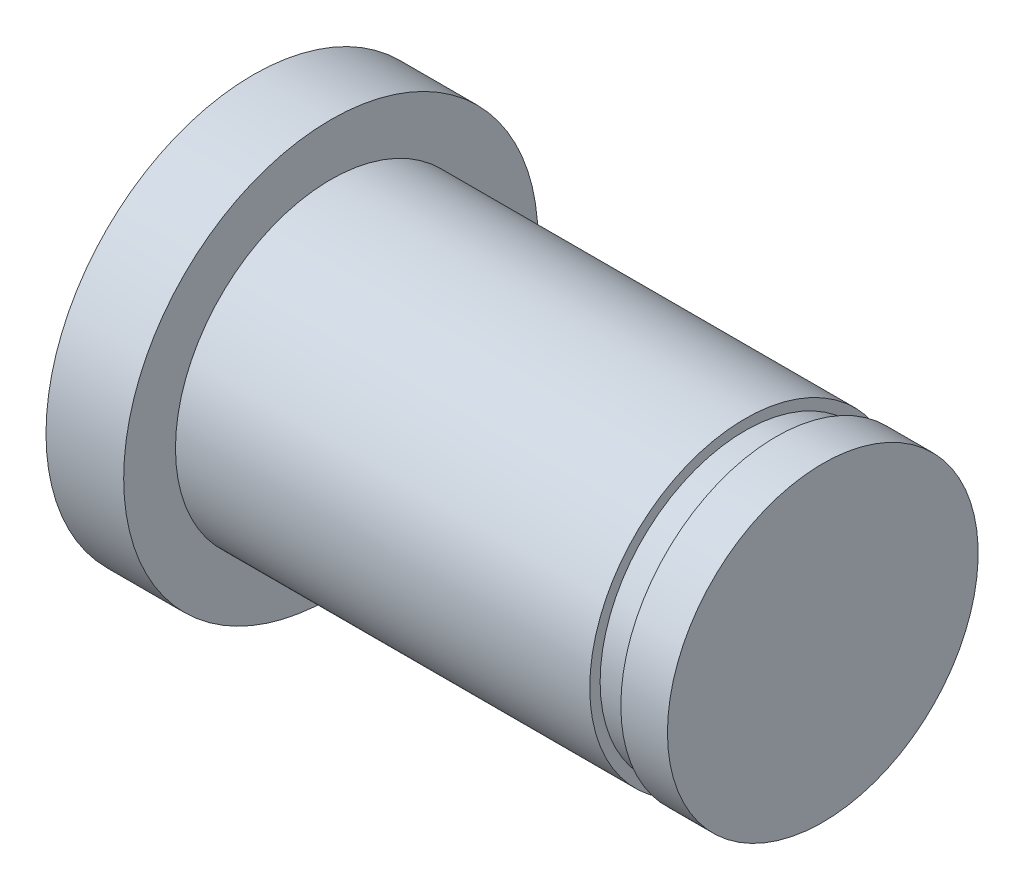
ISO-10303-21;
HEADER;
FILE_DESCRIPTION(('STEP AP214'),'2;1');
FILE_NAME('part.step','',(''),(''),'','','');
FILE_SCHEMA(('AUTOMOTIVE_DESIGN { 1 0 10303 214 1 1 1 1 }'));
ENDSEC;
DATA;
#1=APPLICATION_CONTEXT('core data for automotive mechanical design processes');
#2=APPLICATION_PROTOCOL_DEFINITION('international standard','automotive_design',2000,#1);
#3=PRODUCT_CONTEXT('',#1,'mechanical');
#4=PRODUCT('Part','Part','',(#3));
#5=PRODUCT_RELATED_PRODUCT_CATEGORY('part','',(#4));
#6=PRODUCT_DEFINITION_FORMATION('','',#4);
#7=PRODUCT_DEFINITION_CONTEXT('part definition',#1,'design');
#8=PRODUCT_DEFINITION('design','',#6,#7);
#9=PRODUCT_DEFINITION_SHAPE('','',#8);
#10=(LENGTH_UNIT() NAMED_UNIT(*) SI_UNIT(.MILLI.,.METRE.));
#11=(NAMED_UNIT(*) PLANE_ANGLE_UNIT() SI_UNIT($,.RADIAN.));
#12=(NAMED_UNIT(*) SI_UNIT($,.STERADIAN.) SOLID_ANGLE_UNIT());
#13=UNCERTAINTY_MEASURE_WITH_UNIT(LENGTH_MEASURE(1.E-05),#10,'distance_accuracy_value','');
#14=(GEOMETRIC_REPRESENTATION_CONTEXT(3) GLOBAL_UNCERTAINTY_ASSIGNED_CONTEXT((#13)) GLOBAL_UNIT_ASSIGNED_CONTEXT((#10,
#11,#12)) REPRESENTATION_CONTEXT('',''));
#15=CARTESIAN_POINT('',(0.,0.,0.));
#16=DIRECTION('',(0.,0.,1.));
#17=DIRECTION('',(1.,0.,0.));
#18=AXIS2_PLACEMENT_3D('',#15,#16,#17);
#19=CARTESIAN_POINT('',(11.,0.,-3.));
#20=DIRECTION('',(-1.,0.,0.));
#21=DIRECTION('',(0.,0.,1.));
#22=AXIS2_PLACEMENT_3D('',#19,#20,#21);
#23=PLANE('',#22);
#24=CARTESIAN_POINT('',(11.,0.,0.));
#25=DIRECTION('',(-1.,0.,0.));
#26=DIRECTION('',(0.,0.,1.));
#27=AXIS2_PLACEMENT_3D('',#24,#25,#26);
#28=CIRCLE('',#27,3.);
#29=CARTESIAN_POINT('',(11.,0.,3.));
#30=VERTEX_POINT('',#29);
#31=EDGE_CURVE('E18',#30,#30,#28,.T.);
#32=ORIENTED_EDGE('',*,*,#31,.F.);
#33=EDGE_LOOP('',(#32));
#34=FACE_BOUND('',#33,.T.);
#35=ADVANCED_FACE('F15',(#34),#23,.F.);
#36=CARTESIAN_POINT('',(0.,0.,0.));
#37=DIRECTION('',(-1.,0.,0.));
#38=DIRECTION('',(0.,0.,1.));
#39=AXIS2_PLACEMENT_3D('',#36,#37,#38);
#40=CYLINDRICAL_SURFACE('',#39,3.);
#41=CARTESIAN_POINT('',(10.1,0.,0.));
#42=DIRECTION('',(-1.,0.,0.));
#43=DIRECTION('',(0.,0.,1.));
#44=AXIS2_PLACEMENT_3D('',#41,#42,#43);
#45=CIRCLE('',#44,3.);
#46=CARTESIAN_POINT('',(10.1,0.,3.));
#47=VERTEX_POINT('',#46);
#48=EDGE_CURVE('E40',#47,#47,#45,.F.);
#49=ORIENTED_EDGE('',*,*,#48,.T.);
#50=EDGE_LOOP('',(#49));
#51=FACE_BOUND('',#50,.T.);
#52=ORIENTED_EDGE('',*,*,#31,.T.);
#53=EDGE_LOOP('',(#52));
#54=FACE_BOUND('',#53,.T.);
#55=ADVANCED_FACE('F47',(#51,#54),#40,.T.);
#56=CARTESIAN_POINT('',(10.1,0.,-2.8));
#57=DIRECTION('',(1.,0.,0.));
#58=DIRECTION('',(0.,0.,-1.));
#59=AXIS2_PLACEMENT_3D('',#56,#57,#58);
#60=PLANE('',#59);
#61=ORIENTED_EDGE('',*,*,#48,.F.);
#62=EDGE_LOOP('',(#61));
#63=FACE_BOUND('',#62,.T.);
#64=CARTESIAN_POINT('',(10.1,0.,0.));
#65=DIRECTION('',(-1.,0.,0.));
#66=DIRECTION('',(0.,0.,1.));
#67=AXIS2_PLACEMENT_3D('',#64,#65,#66);
#68=CIRCLE('',#67,2.8);
#69=CARTESIAN_POINT('',(10.1,0.,2.8));
#70=VERTEX_POINT('',#69);
#71=EDGE_CURVE('E38',#70,#70,#68,.T.);
#72=ORIENTED_EDGE('',*,*,#71,.F.);
#73=EDGE_LOOP('',(#72));
#74=FACE_BOUND('',#73,.T.);
#75=ADVANCED_FACE('F54',(#63,#74),#60,.F.);
#76=CARTESIAN_POINT('',(0.,0.,0.));
#77=DIRECTION('',(1.,0.,0.));
#78=DIRECTION('',(0.,0.,-1.));
#79=AXIS2_PLACEMENT_3D('',#76,#77,#78);
#80=PLANE('',#79);
#81=CARTESIAN_POINT('',(0.,0.,0.));
#82=DIRECTION('',(-1.,0.,0.));
#83=DIRECTION('',(0.,0.,1.));
#84=AXIS2_PLACEMENT_3D('',#81,#82,#83);
#85=CIRCLE('',#84,4.);
#86=CARTESIAN_POINT('',(0.,0.,4.));
#87=VERTEX_POINT('',#86);
#88=EDGE_CURVE('E35',#87,#87,#85,.F.);
#89=ORIENTED_EDGE('',*,*,#88,.F.);
#90=EDGE_LOOP('',(#89));
#91=FACE_BOUND('',#90,.T.);
#92=ADVANCED_FACE('F77',(#91),#80,.F.);
#93=CARTESIAN_POINT('',(0.,0.,0.));
#94=DIRECTION('',(-1.,0.,0.));
#95=DIRECTION('',(0.,0.,1.));
#96=AXIS2_PLACEMENT_3D('',#93,#94,#95);
#97=CYLINDRICAL_SURFACE('',#96,2.8);
#98=CARTESIAN_POINT('',(9.5,0.,0.));
#99=DIRECTION('',(-1.,0.,0.));
#100=DIRECTION('',(0.,0.,1.));
#101=AXIS2_PLACEMENT_3D('',#98,#99,#100);
#102=CIRCLE('',#101,2.8);
#103=CARTESIAN_POINT('',(9.5,0.,2.8));
#104=VERTEX_POINT('',#103);
#105=EDGE_CURVE('E32',#104,#104,#102,.F.);
#106=ORIENTED_EDGE('',*,*,#105,.T.);
#107=EDGE_LOOP('',(#106));
#108=FACE_BOUND('',#107,.T.);
#109=ORIENTED_EDGE('',*,*,#71,.T.);
#110=EDGE_LOOP('',(#109));
#111=FACE_BOUND('',#110,.T.);
#112=ADVANCED_FACE('F73',(#108,#111),#97,.T.);
#113=CARTESIAN_POINT('',(0.,0.,0.));
#114=DIRECTION('',(-1.,0.,0.));
#115=DIRECTION('',(0.,0.,1.));
#116=AXIS2_PLACEMENT_3D('',#113,#114,#115);
#117=CYLINDRICAL_SURFACE('',#116,4.);
#118=ORIENTED_EDGE('',*,*,#88,.T.);
#119=EDGE_LOOP('',(#118));
#120=FACE_BOUND('',#119,.T.);
#121=CARTESIAN_POINT('',(1.5,0.,0.));
#122=DIRECTION('',(-1.,0.,0.));
#123=DIRECTION('',(0.,0.,1.));
#124=AXIS2_PLACEMENT_3D('',#121,#122,#123);
#125=CIRCLE('',#124,4.);
#126=CARTESIAN_POINT('',(1.5,0.,4.));
#127=VERTEX_POINT('',#126);
#128=EDGE_CURVE('E27',#127,#127,#125,.T.);
#129=ORIENTED_EDGE('',*,*,#128,.T.);
#130=EDGE_LOOP('',(#129));
#131=FACE_BOUND('',#130,.T.);
#132=ADVANCED_FACE('F69',(#120,#131),#117,.T.);
#133=CARTESIAN_POINT('',(9.5,0.,-3.));
#134=DIRECTION('',(-1.,0.,0.));
#135=DIRECTION('',(0.,0.,1.));
#136=AXIS2_PLACEMENT_3D('',#133,#134,#135);
#137=PLANE('',#136);
#138=ORIENTED_EDGE('',*,*,#105,.F.);
#139=EDGE_LOOP('',(#138));
#140=FACE_BOUND('',#139,.T.);
#141=CARTESIAN_POINT('',(9.5,0.,0.));
#142=DIRECTION('',(-1.,0.,0.));
#143=DIRECTION('',(0.,0.,1.));
#144=AXIS2_PLACEMENT_3D('',#141,#142,#143);
#145=CIRCLE('',#144,3.);
#146=CARTESIAN_POINT('',(9.5,0.,3.));
#147=VERTEX_POINT('',#146);
#148=EDGE_CURVE('E22',#147,#147,#145,.T.);
#149=ORIENTED_EDGE('',*,*,#148,.F.);
#150=EDGE_LOOP('',(#149));
#151=FACE_BOUND('',#150,.T.);
#152=ADVANCED_FACE('F62',(#140,#151),#137,.F.);
#153=CARTESIAN_POINT('',(1.5,0.,-4.));
#154=DIRECTION('',(-1.,0.,0.));
#155=DIRECTION('',(0.,0.,1.));
#156=AXIS2_PLACEMENT_3D('',#153,#154,#155);
#157=PLANE('',#156);
#158=CARTESIAN_POINT('',(1.5,0.,0.));
#159=DIRECTION('',(-1.,0.,0.));
#160=DIRECTION('',(0.,0.,1.));
#161=AXIS2_PLACEMENT_3D('',#158,#159,#160);
#162=CIRCLE('',#161,3.);
#163=CARTESIAN_POINT('',(1.5,0.,3.));
#164=VERTEX_POINT('',#163);
#165=EDGE_CURVE('E10',#164,#164,#162,.F.);
#166=ORIENTED_EDGE('',*,*,#165,.F.);
#167=EDGE_LOOP('',(#166));
#168=FACE_BOUND('',#167,.T.);
#169=ORIENTED_EDGE('',*,*,#128,.F.);
#170=EDGE_LOOP('',(#169));
#171=FACE_BOUND('',#170,.T.);
#172=ADVANCED_FACE('F57',(#168,#171),#157,.F.);
#173=CARTESIAN_POINT('',(0.,0.,0.));
#174=DIRECTION('',(-1.,0.,0.));
#175=DIRECTION('',(0.,0.,1.));
#176=AXIS2_PLACEMENT_3D('',#173,#174,#175);
#177=CYLINDRICAL_SURFACE('',#176,3.);
#178=ORIENTED_EDGE('',*,*,#165,.T.);
#179=EDGE_LOOP('',(#178));
#180=FACE_BOUND('',#179,.T.);
#181=ORIENTED_EDGE('',*,*,#148,.T.);
#182=EDGE_LOOP('',(#181));
#183=FACE_BOUND('',#182,.T.);
#184=ADVANCED_FACE('F55',(#180,#183),#177,.T.);
#185=CLOSED_SHELL('',(#35,#55,#75,#92,#112,#132,#152,#172,#184));
#186=MANIFOLD_SOLID_BREP('B1',#185);
#187=ADVANCED_BREP_SHAPE_REPRESENTATION('',(#18,#186),#14);
#188=SHAPE_DEFINITION_REPRESENTATION(#9,#187);
ENDSEC;
END-ISO-10303-21;
